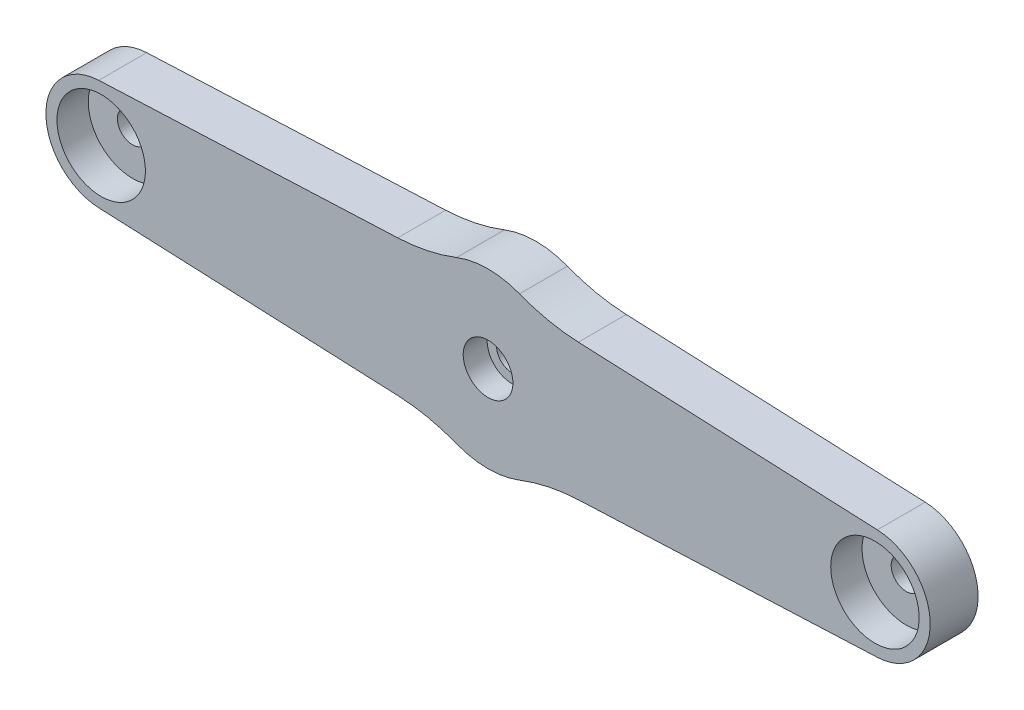
ISO-10303-21;
HEADER;
FILE_DESCRIPTION(('STEP AP214'),'2;1');
FILE_NAME('part.step','',(''),(''),'','','');
FILE_SCHEMA(('AUTOMOTIVE_DESIGN { 1 0 10303 214 1 1 1 1 }'));
ENDSEC;
DATA;
#1=APPLICATION_CONTEXT('core data for automotive mechanical design processes');
#2=APPLICATION_PROTOCOL_DEFINITION('international standard','automotive_design',2000,#1);
#3=PRODUCT_CONTEXT('',#1,'mechanical');
#4=PRODUCT('Part','Part','',(#3));
#5=PRODUCT_RELATED_PRODUCT_CATEGORY('part','',(#4));
#6=PRODUCT_DEFINITION_FORMATION('','',#4);
#7=PRODUCT_DEFINITION_CONTEXT('part definition',#1,'design');
#8=PRODUCT_DEFINITION('design','',#6,#7);
#9=PRODUCT_DEFINITION_SHAPE('','',#8);
#10=(LENGTH_UNIT() NAMED_UNIT(*) SI_UNIT(.MILLI.,.METRE.));
#11=(NAMED_UNIT(*) PLANE_ANGLE_UNIT() SI_UNIT($,.RADIAN.));
#12=(NAMED_UNIT(*) SI_UNIT($,.STERADIAN.) SOLID_ANGLE_UNIT());
#13=UNCERTAINTY_MEASURE_WITH_UNIT(LENGTH_MEASURE(1.E-05),#10,'distance_accuracy_value','');
#14=(GEOMETRIC_REPRESENTATION_CONTEXT(3) GLOBAL_UNCERTAINTY_ASSIGNED_CONTEXT((#13)) GLOBAL_UNIT_ASSIGNED_CONTEXT((#10,
#11,#12)) REPRESENTATION_CONTEXT('',''));
#15=CARTESIAN_POINT('',(0.,0.,0.));
#16=DIRECTION('',(0.,0.,1.));
#17=DIRECTION('',(1.,0.,0.));
#18=AXIS2_PLACEMENT_3D('',#15,#16,#17);
#19=CARTESIAN_POINT('',(0.,29.,75.25));
#20=DIRECTION('',(0.,0.,-1.));
#21=DIRECTION('',(-1.,0.,0.));
#22=AXIS2_PLACEMENT_3D('',#19,#20,#21);
#23=CYLINDRICAL_SURFACE('',#22,6.75);
#24=CARTESIAN_POINT('',(0.,29.,72.));
#25=DIRECTION('',(0.,0.,-1.));
#26=DIRECTION('',(-1.,0.,0.));
#27=AXIS2_PLACEMENT_3D('',#24,#25,#26);
#28=CIRCLE('',#27,6.75);
#29=CARTESIAN_POINT('',(-6.74999999999998,29.,72.));
#30=VERTEX_POINT('',#29);
#31=EDGE_CURVE('E205',#30,#30,#28,.T.);
#32=ORIENTED_EDGE('',*,*,#31,.T.);
#33=EDGE_LOOP('',(#32));
#34=FACE_BOUND('',#33,.T.);
#35=CARTESIAN_POINT('',(0.,29.,78.5));
#36=DIRECTION('',(0.,0.,-1.));
#37=DIRECTION('',(-1.,0.,0.));
#38=AXIS2_PLACEMENT_3D('',#35,#36,#37);
#39=CIRCLE('',#38,6.75);
#40=CARTESIAN_POINT('',(-6.74999999999998,29.,78.5));
#41=VERTEX_POINT('',#40);
#42=EDGE_CURVE('E19',#41,#41,#39,.T.);
#43=ORIENTED_EDGE('',*,*,#42,.F.);
#44=EDGE_LOOP('',(#43));
#45=FACE_BOUND('',#44,.T.);
#46=ADVANCED_FACE('F16',(#34,#45),#23,.F.);
#47=CARTESIAN_POINT('',(-105.,29.,78.5));
#48=DIRECTION('',(0.,0.,-1.));
#49=DIRECTION('',(-1.,0.,0.));
#50=AXIS2_PLACEMENT_3D('',#47,#48,#49);
#51=CYLINDRICAL_SURFACE('',#50,12.);
#52=CARTESIAN_POINT('',(-105.,29.,70.));
#53=DIRECTION('',(0.,0.,-1.));
#54=DIRECTION('',(-1.,0.,0.));
#55=AXIS2_PLACEMENT_3D('',#52,#53,#54);
#56=CIRCLE('',#55,12.);
#57=CARTESIAN_POINT('',(-117.,29.,70.));
#58=VERTEX_POINT('',#57);
#59=EDGE_CURVE('E202',#58,#58,#56,.F.);
#60=ORIENTED_EDGE('',*,*,#59,.F.);
#61=EDGE_LOOP('',(#60));
#62=FACE_BOUND('',#61,.T.);
#63=CARTESIAN_POINT('',(-105.,29.,78.5));
#64=DIRECTION('',(0.,0.,-1.));
#65=DIRECTION('',(-1.,0.,0.));
#66=AXIS2_PLACEMENT_3D('',#63,#64,#65);
#67=CIRCLE('',#66,12.);
#68=CARTESIAN_POINT('',(-117.,29.,78.5));
#69=VERTEX_POINT('',#68);
#70=EDGE_CURVE('E208',#69,#69,#67,.T.);
#71=ORIENTED_EDGE('',*,*,#70,.F.);
#72=EDGE_LOOP('',(#71));
#73=FACE_BOUND('',#72,.T.);
#74=ADVANCED_FACE('F219',(#62,#73),#51,.F.);
#75=CARTESIAN_POINT('',(105.,29.,78.5));
#76=DIRECTION('',(0.,0.,-1.));
#77=DIRECTION('',(-1.,0.,0.));
#78=AXIS2_PLACEMENT_3D('',#75,#76,#77);
#79=CYLINDRICAL_SURFACE('',#78,12.);
#80=CARTESIAN_POINT('',(105.,29.,70.));
#81=DIRECTION('',(0.,0.,-1.));
#82=DIRECTION('',(-1.,0.,0.));
#83=AXIS2_PLACEMENT_3D('',#80,#81,#82);
#84=CIRCLE('',#83,12.);
#85=CARTESIAN_POINT('',(93.,29.,70.));
#86=VERTEX_POINT('',#85);
#87=EDGE_CURVE('E139',#86,#86,#84,.F.);
#88=ORIENTED_EDGE('',*,*,#87,.F.);
#89=EDGE_LOOP('',(#88));
#90=FACE_BOUND('',#89,.T.);
#91=CARTESIAN_POINT('',(105.,29.,78.5));
#92=DIRECTION('',(0.,0.,-1.));
#93=DIRECTION('',(-1.,0.,0.));
#94=AXIS2_PLACEMENT_3D('',#91,#92,#93);
#95=CIRCLE('',#94,12.);
#96=CARTESIAN_POINT('',(93.,29.,78.5));
#97=VERTEX_POINT('',#96);
#98=EDGE_CURVE('E210',#97,#97,#95,.T.);
#99=ORIENTED_EDGE('',*,*,#98,.F.);
#100=EDGE_LOOP('',(#99));
#101=FACE_BOUND('',#100,.T.);
#102=ADVANCED_FACE('F225',(#90,#101),#79,.F.);
#103=CARTESIAN_POINT('',(0.,29.0000000000001,78.5));
#104=DIRECTION('',(0.,0.,1.));
#105=DIRECTION('',(1.,0.,0.));
#106=AXIS2_PLACEMENT_3D('',#103,#104,#105);
#107=PLANE('',#106);
#108=ORIENTED_EDGE('',*,*,#70,.T.);
#109=EDGE_LOOP('',(#108));
#110=FACE_BOUND('',#109,.T.);
#111=ORIENTED_EDGE('',*,*,#98,.T.);
#112=EDGE_LOOP('',(#111));
#113=FACE_BOUND('',#112,.T.);
#114=ORIENTED_EDGE('',*,*,#42,.T.);
#115=EDGE_LOOP('',(#114));
#116=FACE_BOUND('',#115,.T.);
#117=CARTESIAN_POINT('',(26.6951631788374,-39.4807875455241,78.5));
#118=DIRECTION('',(0.,0.,1.));
#119=DIRECTION('',(1.,0.,0.));
#120=AXIS2_PLACEMENT_3D('',#117,#118,#119);
#121=CIRCLE('',#120,50.);
#122=CARTESIAN_POINT('',(8.5351882272473,7.10478221333597,78.5));
#123=VERTEX_POINT('',#122);
#124=CARTESIAN_POINT('',(24.5141938105712,10.4716235335688,78.5));
#125=VERTEX_POINT('',#124);
#126=EDGE_CURVE('E137',#123,#125,#121,.F.);
#127=ORIENTED_EDGE('',*,*,#126,.T.);
#128=DIRECTION('',(0.999048221581858,0.0436193873653249,0.));
#129=VECTOR('',#128,1.);
#130=CARTESIAN_POINT('',(24.5141938105712,10.4716235335688,78.5));
#131=LINE('',#130,#129);
#132=CARTESIAN_POINT('',(105.65429081048,14.014276676272,78.5));
#133=VERTEX_POINT('',#132);
#134=EDGE_CURVE('E134',#133,#125,#131,.F.);
#135=ORIENTED_EDGE('',*,*,#134,.F.);
#136=CARTESIAN_POINT('',(105.,29.,78.5));
#137=DIRECTION('',(0.,0.,1.));
#138=DIRECTION('',(1.,0.,0.));
#139=AXIS2_PLACEMENT_3D('',#136,#137,#138);
#140=CIRCLE('',#139,15.0000000000001);
#141=CARTESIAN_POINT('',(105.65429081048,43.9857233237279,78.5));
#142=VERTEX_POINT('',#141);
#143=EDGE_CURVE('E185',#142,#133,#140,.F.);
#144=ORIENTED_EDGE('',*,*,#143,.F.);
#145=DIRECTION('',(-0.999048221581858,0.0436193873653404,0.));
#146=VECTOR('',#145,1.);
#147=CARTESIAN_POINT('',(105.65429081048,43.9857233237279,78.5));
#148=LINE('',#147,#146);
#149=CARTESIAN_POINT('',(24.5141938105676,47.5283764664326,78.5));
#150=VERTEX_POINT('',#149);
#151=EDGE_CURVE('E102',#150,#142,#148,.F.);
#152=ORIENTED_EDGE('',*,*,#151,.F.);
#153=CARTESIAN_POINT('',(26.6951631788346,97.4807875455255,78.5));
#154=DIRECTION('',(0.,0.,1.));
#155=DIRECTION('',(1.,0.,0.));
#156=AXIS2_PLACEMENT_3D('',#153,#154,#155);
#157=CIRCLE('',#156,50.);
#158=CARTESIAN_POINT('',(8.53518822724645,50.8952177866646,78.5));
#159=VERTEX_POINT('',#158);
#160=EDGE_CURVE('E116',#150,#159,#157,.F.);
#161=ORIENTED_EDGE('',*,*,#160,.T.);
#162=CARTESIAN_POINT('',(0.,29.,78.5));
#163=DIRECTION('',(0.,0.,1.));
#164=DIRECTION('',(1.,0.,0.));
#165=AXIS2_PLACEMENT_3D('',#162,#163,#164);
#166=CIRCLE('',#165,23.5);
#167=CARTESIAN_POINT('',(-8.53518822724637,50.8952177866646,78.5));
#168=VERTEX_POINT('',#167);
#169=EDGE_CURVE('E107',#168,#159,#166,.F.);
#170=ORIENTED_EDGE('',*,*,#169,.F.);
#171=CARTESIAN_POINT('',(-26.6951631788344,97.4807875455255,78.5));
#172=DIRECTION('',(0.,0.,1.));
#173=DIRECTION('',(1.,0.,0.));
#174=AXIS2_PLACEMENT_3D('',#171,#172,#173);
#175=CIRCLE('',#174,50.);
#176=CARTESIAN_POINT('',(-24.5141938105673,47.5283764664327,78.5));
#177=VERTEX_POINT('',#176);
#178=EDGE_CURVE('E129',#168,#177,#175,.F.);
#179=ORIENTED_EDGE('',*,*,#178,.T.);
#180=DIRECTION('',(-0.999048221581857,-0.043619387365342,0.));
#181=VECTOR('',#180,1.);
#182=CARTESIAN_POINT('',(-24.5141938105672,47.5283764664327,78.5));
#183=LINE('',#182,#181);
#184=CARTESIAN_POINT('',(-105.65429081048,43.9857233237279,78.5));
#185=VERTEX_POINT('',#184);
#186=EDGE_CURVE('E144',#185,#177,#183,.F.);
#187=ORIENTED_EDGE('',*,*,#186,.F.);
#188=CARTESIAN_POINT('',(-105.,29.,78.5));
#189=DIRECTION('',(0.,0.,1.));
#190=DIRECTION('',(1.,0.,0.));
#191=AXIS2_PLACEMENT_3D('',#188,#189,#190);
#192=CIRCLE('',#191,15.);
#193=CARTESIAN_POINT('',(-105.65429081048,14.0142766762721,78.5));
#194=VERTEX_POINT('',#193);
#195=EDGE_CURVE('E197',#194,#185,#192,.F.);
#196=ORIENTED_EDGE('',*,*,#195,.F.);
#197=DIRECTION('',(0.999048221581858,-0.0436193873653238,0.));
#198=VECTOR('',#197,1.);
#199=CARTESIAN_POINT('',(-105.65429081048,14.0142766762721,78.5));
#200=LINE('',#199,#198);
#201=CARTESIAN_POINT('',(-24.5141938105718,10.471623533569,78.5));
#202=VERTEX_POINT('',#201);
#203=EDGE_CURVE('E140',#202,#194,#200,.F.);
#204=ORIENTED_EDGE('',*,*,#203,.F.);
#205=CARTESIAN_POINT('',(-26.695163178838,-39.4807875455239,78.5));
#206=DIRECTION('',(0.,0.,1.));
#207=DIRECTION('',(1.,0.,0.));
#208=AXIS2_PLACEMENT_3D('',#205,#206,#207);
#209=CIRCLE('',#208,50.);
#210=CARTESIAN_POINT('',(-8.53518822724747,7.10478221333602,78.5));
#211=VERTEX_POINT('',#210);
#212=EDGE_CURVE('E193',#202,#211,#209,.F.);
#213=ORIENTED_EDGE('',*,*,#212,.T.);
#214=CARTESIAN_POINT('',(0.,29.,78.5));
#215=DIRECTION('',(0.,0.,1.));
#216=DIRECTION('',(1.,0.,0.));
#217=AXIS2_PLACEMENT_3D('',#214,#215,#216);
#218=CIRCLE('',#217,23.4999999999998);
#219=EDGE_CURVE('E190',#123,#211,#218,.F.);
#220=ORIENTED_EDGE('',*,*,#219,.F.);
#221=EDGE_LOOP('',(#127,#135,#144,#152,#161,#170,#179,#187,#196,#204,#213,#220));
#222=FACE_BOUND('',#221,.T.);
#223=ADVANCED_FACE('F119',(#110,#113,#116,#222),#107,.T.);
#224=CARTESIAN_POINT('',(0.,29.,72.));
#225=DIRECTION('',(0.,0.,-1.));
#226=DIRECTION('',(-1.,0.,0.));
#227=AXIS2_PLACEMENT_3D('',#224,#225,#226);
#228=PLANE('',#227);
#229=CARTESIAN_POINT('',(0.,29.,72.));
#230=DIRECTION('',(0.,0.,-1.));
#231=DIRECTION('',(-1.,0.,0.));
#232=AXIS2_PLACEMENT_3D('',#229,#230,#231);
#233=CIRCLE('',#232,4.2);
#234=CARTESIAN_POINT('',(-4.19999999999998,29.,72.));
#235=VERTEX_POINT('',#234);
#236=EDGE_CURVE('E182',#235,#235,#233,.T.);
#237=ORIENTED_EDGE('',*,*,#236,.T.);
#238=EDGE_LOOP('',(#237));
#239=FACE_BOUND('',#238,.T.);
#240=ORIENTED_EDGE('',*,*,#31,.F.);
#241=EDGE_LOOP('',(#240));
#242=FACE_BOUND('',#241,.T.);
#243=ADVANCED_FACE('F298',(#239,#242),#228,.F.);
#244=CARTESIAN_POINT('',(-105.,29.,70.));
#245=DIRECTION('',(0.,0.,1.));
#246=DIRECTION('',(1.,0.,0.));
#247=AXIS2_PLACEMENT_3D('',#244,#245,#246);
#248=PLANE('',#247);
#249=CARTESIAN_POINT('',(-105.,29.,70.));
#250=DIRECTION('',(0.,0.,-1.));
#251=DIRECTION('',(0.,1.,0.));
#252=AXIS2_PLACEMENT_3D('',#249,#250,#251);
#253=CIRCLE('',#252,4.1);
#254=CARTESIAN_POINT('',(-105.,33.1,70.));
#255=VERTEX_POINT('',#254);
#256=EDGE_CURVE('E179',#255,#255,#253,.T.);
#257=ORIENTED_EDGE('',*,*,#256,.T.);
#258=EDGE_LOOP('',(#257));
#259=FACE_BOUND('',#258,.T.);
#260=ORIENTED_EDGE('',*,*,#59,.T.);
#261=EDGE_LOOP('',(#260));
#262=FACE_BOUND('',#261,.T.);
#263=ADVANCED_FACE('F294',(#259,#262),#248,.T.);
#264=CARTESIAN_POINT('',(105.,29.,70.));
#265=DIRECTION('',(0.,0.,1.));
#266=DIRECTION('',(1.,0.,0.));
#267=AXIS2_PLACEMENT_3D('',#264,#265,#266);
#268=PLANE('',#267);
#269=CARTESIAN_POINT('',(105.,29.,70.));
#270=DIRECTION('',(0.,0.,-1.));
#271=DIRECTION('',(0.,1.,0.));
#272=AXIS2_PLACEMENT_3D('',#269,#270,#271);
#273=CIRCLE('',#272,4.1);
#274=CARTESIAN_POINT('',(105.,33.1,70.));
#275=VERTEX_POINT('',#274);
#276=EDGE_CURVE('E176',#275,#275,#273,.T.);
#277=ORIENTED_EDGE('',*,*,#276,.T.);
#278=EDGE_LOOP('',(#277));
#279=FACE_BOUND('',#278,.T.);
#280=ORIENTED_EDGE('',*,*,#87,.T.);
#281=EDGE_LOOP('',(#280));
#282=FACE_BOUND('',#281,.T.);
#283=ADVANCED_FACE('F290',(#279,#282),#268,.T.);
#284=CARTESIAN_POINT('',(105.65429081048,43.9857233237279,65.5));
#285=DIRECTION('',(0.0436193873653404,0.999048221581858,0.));
#286=DIRECTION('',(-0.999048221581858,0.0436193873653404,0.));
#287=AXIS2_PLACEMENT_3D('',#284,#285,#286);
#288=PLANE('',#287);
#289=ORIENTED_EDGE('',*,*,#151,.T.);
#290=DIRECTION('',(0.,0.,1.));
#291=VECTOR('',#290,1.);
#292=CARTESIAN_POINT('',(105.65429081048,43.985723323728,65.5));
#293=LINE('',#292,#291);
#294=CARTESIAN_POINT('',(105.65429081048,43.9857233237279,65.5));
#295=VERTEX_POINT('',#294);
#296=EDGE_CURVE('E187',#295,#142,#293,.T.);
#297=ORIENTED_EDGE('',*,*,#296,.F.);
#298=DIRECTION('',(-0.999048221581858,0.0436193873653408,0.));
#299=VECTOR('',#298,1.);
#300=CARTESIAN_POINT('',(105.65429081048,43.9857233237279,65.5));
#301=LINE('',#300,#299);
#302=CARTESIAN_POINT('',(24.5141938105676,47.5283764664326,65.5));
#303=VERTEX_POINT('',#302);
#304=EDGE_CURVE('E175',#295,#303,#301,.T.);
#305=ORIENTED_EDGE('',*,*,#304,.T.);
#306=DIRECTION('',(0.,0.,1.));
#307=VECTOR('',#306,1.);
#308=CARTESIAN_POINT('',(24.5141938105676,47.5283764664326,65.5));
#309=LINE('',#308,#307);
#310=EDGE_CURVE('E122',#303,#150,#309,.T.);
#311=ORIENTED_EDGE('',*,*,#310,.T.);
#312=EDGE_LOOP('',(#289,#297,#305,#311));
#313=FACE_BOUND('',#312,.T.);
#314=ADVANCED_FACE('F287',(#313),#288,.T.);
#315=CARTESIAN_POINT('',(26.6951631788346,97.4807875455255,65.5));
#316=DIRECTION('',(0.,0.,1.));
#317=DIRECTION('',(1.,0.,0.));
#318=AXIS2_PLACEMENT_3D('',#315,#316,#317);
#319=CYLINDRICAL_SURFACE('',#318,50.);
#320=DIRECTION('',(0.,0.,1.));
#321=VECTOR('',#320,1.);
#322=CARTESIAN_POINT('',(8.53518822724645,50.8952177866646,65.5));
#323=LINE('',#322,#321);
#324=CARTESIAN_POINT('',(8.53518822724645,50.8952177866646,65.5));
#325=VERTEX_POINT('',#324);
#326=EDGE_CURVE('E111',#159,#325,#323,.F.);
#327=ORIENTED_EDGE('',*,*,#326,.F.);
#328=ORIENTED_EDGE('',*,*,#160,.F.);
#329=ORIENTED_EDGE('',*,*,#310,.F.);
#330=CARTESIAN_POINT('',(26.6951631788346,97.4807875455255,65.5));
#331=DIRECTION('',(0.,0.,1.));
#332=DIRECTION('',(1.,0.,0.));
#333=AXIS2_PLACEMENT_3D('',#330,#331,#332);
#334=CIRCLE('',#333,50.);
#335=EDGE_CURVE('E127',#303,#325,#334,.F.);
#336=ORIENTED_EDGE('',*,*,#335,.T.);
#337=EDGE_LOOP('',(#327,#328,#329,#336));
#338=FACE_BOUND('',#337,.T.);
#339=ADVANCED_FACE('F125',(#338),#319,.F.);
#340=CARTESIAN_POINT('',(0.,29.,65.5));
#341=DIRECTION('',(0.,0.,1.));
#342=DIRECTION('',(1.,0.,0.));
#343=AXIS2_PLACEMENT_3D('',#340,#341,#342);
#344=CYLINDRICAL_SURFACE('',#343,23.5);
#345=ORIENTED_EDGE('',*,*,#169,.T.);
#346=ORIENTED_EDGE('',*,*,#326,.T.);
#347=CARTESIAN_POINT('',(0.,29.,65.5));
#348=DIRECTION('',(0.,0.,1.));
#349=DIRECTION('',(1.,0.,0.));
#350=AXIS2_PLACEMENT_3D('',#347,#348,#349);
#351=CIRCLE('',#350,23.5);
#352=CARTESIAN_POINT('',(-8.53518822724636,50.8952177866646,65.5));
#353=VERTEX_POINT('',#352);
#354=EDGE_CURVE('E172',#325,#353,#351,.T.);
#355=ORIENTED_EDGE('',*,*,#354,.T.);
#356=DIRECTION('',(0.,0.,1.));
#357=VECTOR('',#356,1.);
#358=CARTESIAN_POINT('',(-8.53518822724638,50.8952177866646,65.5));
#359=LINE('',#358,#357);
#360=EDGE_CURVE('E113',#353,#168,#359,.T.);
#361=ORIENTED_EDGE('',*,*,#360,.T.);
#362=EDGE_LOOP('',(#345,#346,#355,#361));
#363=FACE_BOUND('',#362,.T.);
#364=ADVANCED_FACE('F108',(#363),#344,.T.);
#365=CARTESIAN_POINT('',(-26.6951631788344,97.4807875455255,65.5));
#366=DIRECTION('',(0.,0.,1.));
#367=DIRECTION('',(1.,0.,0.));
#368=AXIS2_PLACEMENT_3D('',#365,#366,#367);
#369=CYLINDRICAL_SURFACE('',#368,50.);
#370=DIRECTION('',(0.,0.,1.));
#371=VECTOR('',#370,1.);
#372=CARTESIAN_POINT('',(-24.5141938105673,47.5283764664327,65.5));
#373=LINE('',#372,#371);
#374=CARTESIAN_POINT('',(-24.5141938105673,47.5283764664327,65.5));
#375=VERTEX_POINT('',#374);
#376=EDGE_CURVE('E145',#177,#375,#373,.F.);
#377=ORIENTED_EDGE('',*,*,#376,.F.);
#378=ORIENTED_EDGE('',*,*,#178,.F.);
#379=ORIENTED_EDGE('',*,*,#360,.F.);
#380=CARTESIAN_POINT('',(-26.6951631788344,97.4807875455255,65.5));
#381=DIRECTION('',(0.,0.,1.));
#382=DIRECTION('',(1.,0.,0.));
#383=AXIS2_PLACEMENT_3D('',#380,#381,#382);
#384=CIRCLE('',#383,50.);
#385=EDGE_CURVE('E169',#353,#375,#384,.F.);
#386=ORIENTED_EDGE('',*,*,#385,.T.);
#387=EDGE_LOOP('',(#377,#378,#379,#386));
#388=FACE_BOUND('',#387,.T.);
#389=ADVANCED_FACE('F278',(#388),#369,.F.);
#390=CARTESIAN_POINT('',(-24.5141938105672,47.5283764664327,65.5));
#391=DIRECTION('',(-0.043619387365342,0.999048221581857,0.));
#392=DIRECTION('',(-0.999048221581857,-0.043619387365342,0.));
#393=AXIS2_PLACEMENT_3D('',#390,#391,#392);
#394=PLANE('',#393);
#395=ORIENTED_EDGE('',*,*,#186,.T.);
#396=ORIENTED_EDGE('',*,*,#376,.T.);
#397=DIRECTION('',(-0.999048221581858,-0.0436193873653418,0.));
#398=VECTOR('',#397,1.);
#399=CARTESIAN_POINT('',(-24.5141938105673,47.5283764664327,65.5));
#400=LINE('',#399,#398);
#401=CARTESIAN_POINT('',(-105.65429081048,43.9857233237279,65.5));
#402=VERTEX_POINT('',#401);
#403=EDGE_CURVE('E168',#375,#402,#400,.T.);
#404=ORIENTED_EDGE('',*,*,#403,.T.);
#405=DIRECTION('',(0.,0.,1.));
#406=VECTOR('',#405,1.);
#407=CARTESIAN_POINT('',(-105.65429081048,43.9857233237279,65.5));
#408=LINE('',#407,#406);
#409=EDGE_CURVE('E143',#185,#402,#408,.F.);
#410=ORIENTED_EDGE('',*,*,#409,.F.);
#411=EDGE_LOOP('',(#395,#396,#404,#410));
#412=FACE_BOUND('',#411,.T.);
#413=ADVANCED_FACE('F274',(#412),#394,.T.);
#414=CARTESIAN_POINT('',(-105.,29.,65.5));
#415=DIRECTION('',(0.,0.,1.));
#416=DIRECTION('',(1.,0.,0.));
#417=AXIS2_PLACEMENT_3D('',#414,#415,#416);
#418=CYLINDRICAL_SURFACE('',#417,15.);
#419=ORIENTED_EDGE('',*,*,#195,.T.);
#420=ORIENTED_EDGE('',*,*,#409,.T.);
#421=CARTESIAN_POINT('',(-105.,29.,65.5));
#422=DIRECTION('',(0.,0.,1.));
#423=DIRECTION('',(1.,0.,0.));
#424=AXIS2_PLACEMENT_3D('',#421,#422,#423);
#425=CIRCLE('',#424,15.);
#426=CARTESIAN_POINT('',(-105.65429081048,14.0142766762721,65.5));
#427=VERTEX_POINT('',#426);
#428=EDGE_CURVE('E165',#402,#427,#425,.T.);
#429=ORIENTED_EDGE('',*,*,#428,.T.);
#430=DIRECTION('',(0.,0.,1.));
#431=VECTOR('',#430,1.);
#432=CARTESIAN_POINT('',(-105.65429081048,14.0142766762721,65.5));
#433=LINE('',#432,#431);
#434=EDGE_CURVE('E142',#194,#427,#433,.F.);
#435=ORIENTED_EDGE('',*,*,#434,.F.);
#436=EDGE_LOOP('',(#419,#420,#429,#435));
#437=FACE_BOUND('',#436,.T.);
#438=ADVANCED_FACE('F270',(#437),#418,.T.);
#439=CARTESIAN_POINT('',(-105.65429081048,14.0142766762721,65.5));
#440=DIRECTION('',(-0.0436193873653238,-0.999048221581858,0.));
#441=DIRECTION('',(0.999048221581858,-0.0436193873653238,0.));
#442=AXIS2_PLACEMENT_3D('',#439,#440,#441);
#443=PLANE('',#442);
#444=ORIENTED_EDGE('',*,*,#203,.T.);
#445=ORIENTED_EDGE('',*,*,#434,.T.);
#446=DIRECTION('',(0.999048221581858,-0.0436193873653234,0.));
#447=VECTOR('',#446,1.);
#448=CARTESIAN_POINT('',(-105.65429081048,14.0142766762721,65.5));
#449=LINE('',#448,#447);
#450=CARTESIAN_POINT('',(-24.5141938105718,10.471623533569,65.5));
#451=VERTEX_POINT('',#450);
#452=EDGE_CURVE('E164',#427,#451,#449,.T.);
#453=ORIENTED_EDGE('',*,*,#452,.T.);
#454=DIRECTION('',(0.,0.,1.));
#455=VECTOR('',#454,1.);
#456=CARTESIAN_POINT('',(-24.5141938105718,10.471623533569,65.5));
#457=LINE('',#456,#455);
#458=EDGE_CURVE('E196',#451,#202,#457,.T.);
#459=ORIENTED_EDGE('',*,*,#458,.T.);
#460=EDGE_LOOP('',(#444,#445,#453,#459));
#461=FACE_BOUND('',#460,.T.);
#462=ADVANCED_FACE('F266',(#461),#443,.T.);
#463=CARTESIAN_POINT('',(-26.695163178838,-39.4807875455239,65.5));
#464=DIRECTION('',(0.,0.,1.));
#465=DIRECTION('',(1.,0.,0.));
#466=AXIS2_PLACEMENT_3D('',#463,#464,#465);
#467=CYLINDRICAL_SURFACE('',#466,50.);
#468=DIRECTION('',(0.,0.,1.));
#469=VECTOR('',#468,1.);
#470=CARTESIAN_POINT('',(-8.53518822724747,7.10478221333603,65.5));
#471=LINE('',#470,#469);
#472=CARTESIAN_POINT('',(-8.53518822724747,7.10478221333602,65.5));
#473=VERTEX_POINT('',#472);
#474=EDGE_CURVE('E192',#211,#473,#471,.F.);
#475=ORIENTED_EDGE('',*,*,#474,.F.);
#476=ORIENTED_EDGE('',*,*,#212,.F.);
#477=ORIENTED_EDGE('',*,*,#458,.F.);
#478=CARTESIAN_POINT('',(-26.695163178838,-39.4807875455239,65.5));
#479=DIRECTION('',(0.,0.,1.));
#480=DIRECTION('',(1.,0.,0.));
#481=AXIS2_PLACEMENT_3D('',#478,#479,#480);
#482=CIRCLE('',#481,50.);
#483=EDGE_CURVE('E161',#451,#473,#482,.F.);
#484=ORIENTED_EDGE('',*,*,#483,.T.);
#485=EDGE_LOOP('',(#475,#476,#477,#484));
#486=FACE_BOUND('',#485,.T.);
#487=ADVANCED_FACE('F262',(#486),#467,.F.);
#488=CARTESIAN_POINT('',(0.,29.,65.5));
#489=DIRECTION('',(0.,0.,1.));
#490=DIRECTION('',(1.,0.,0.));
#491=AXIS2_PLACEMENT_3D('',#488,#489,#490);
#492=CYLINDRICAL_SURFACE('',#491,23.4999999999998);
#493=ORIENTED_EDGE('',*,*,#219,.T.);
#494=ORIENTED_EDGE('',*,*,#474,.T.);
#495=CARTESIAN_POINT('',(0.,29.,65.5));
#496=DIRECTION('',(0.,0.,1.));
#497=DIRECTION('',(1.,0.,0.));
#498=AXIS2_PLACEMENT_3D('',#495,#496,#497);
#499=CIRCLE('',#498,23.4999999999998);
#500=CARTESIAN_POINT('',(8.53518822724729,7.104782213336,65.5));
#501=VERTEX_POINT('',#500);
#502=EDGE_CURVE('E158',#473,#501,#499,.T.);
#503=ORIENTED_EDGE('',*,*,#502,.T.);
#504=DIRECTION('',(0.,0.,1.));
#505=VECTOR('',#504,1.);
#506=CARTESIAN_POINT('',(8.53518822724729,7.104782213336,65.5));
#507=LINE('',#506,#505);
#508=EDGE_CURVE('E189',#501,#123,#507,.T.);
#509=ORIENTED_EDGE('',*,*,#508,.T.);
#510=EDGE_LOOP('',(#493,#494,#503,#509));
#511=FACE_BOUND('',#510,.T.);
#512=ADVANCED_FACE('F258',(#511),#492,.T.);
#513=CARTESIAN_POINT('',(26.6951631788374,-39.4807875455241,65.5));
#514=DIRECTION('',(0.,0.,1.));
#515=DIRECTION('',(1.,0.,0.));
#516=AXIS2_PLACEMENT_3D('',#513,#514,#515);
#517=CYLINDRICAL_SURFACE('',#516,50.);
#518=DIRECTION('',(0.,0.,1.));
#519=VECTOR('',#518,1.);
#520=CARTESIAN_POINT('',(24.5141938105712,10.4716235335688,65.5));
#521=LINE('',#520,#519);
#522=CARTESIAN_POINT('',(24.5141938105712,10.4716235335688,65.5));
#523=VERTEX_POINT('',#522);
#524=EDGE_CURVE('E136',#125,#523,#521,.F.);
#525=ORIENTED_EDGE('',*,*,#524,.F.);
#526=ORIENTED_EDGE('',*,*,#126,.F.);
#527=ORIENTED_EDGE('',*,*,#508,.F.);
#528=CARTESIAN_POINT('',(26.6951631788374,-39.4807875455241,65.5));
#529=DIRECTION('',(0.,0.,1.));
#530=DIRECTION('',(1.,0.,0.));
#531=AXIS2_PLACEMENT_3D('',#528,#529,#530);
#532=CIRCLE('',#531,50.);
#533=EDGE_CURVE('E155',#501,#523,#532,.F.);
#534=ORIENTED_EDGE('',*,*,#533,.T.);
#535=EDGE_LOOP('',(#525,#526,#527,#534));
#536=FACE_BOUND('',#535,.T.);
#537=ADVANCED_FACE('F254',(#536),#517,.F.);
#538=CARTESIAN_POINT('',(24.5141938105712,10.4716235335688,65.5));
#539=DIRECTION('',(0.0436193873653249,-0.999048221581858,0.));
#540=DIRECTION('',(0.999048221581858,0.0436193873653249,0.));
#541=AXIS2_PLACEMENT_3D('',#538,#539,#540);
#542=PLANE('',#541);
#543=ORIENTED_EDGE('',*,*,#134,.T.);
#544=ORIENTED_EDGE('',*,*,#524,.T.);
#545=DIRECTION('',(0.999048221581858,0.0436193873653243,0.));
#546=VECTOR('',#545,1.);
#547=CARTESIAN_POINT('',(24.5141938105712,10.4716235335688,65.5));
#548=LINE('',#547,#546);
#549=CARTESIAN_POINT('',(105.65429081048,14.014276676272,65.5));
#550=VERTEX_POINT('',#549);
#551=EDGE_CURVE('E154',#523,#550,#548,.T.);
#552=ORIENTED_EDGE('',*,*,#551,.T.);
#553=DIRECTION('',(0.,0.,1.));
#554=VECTOR('',#553,1.);
#555=CARTESIAN_POINT('',(105.65429081048,14.014276676272,65.5));
#556=LINE('',#555,#554);
#557=EDGE_CURVE('E34',#133,#550,#556,.F.);
#558=ORIENTED_EDGE('',*,*,#557,.F.);
#559=EDGE_LOOP('',(#543,#544,#552,#558));
#560=FACE_BOUND('',#559,.T.);
#561=ADVANCED_FACE('F251',(#560),#542,.T.);
#562=CARTESIAN_POINT('',(105.,29.,65.5));
#563=DIRECTION('',(0.,0.,1.));
#564=DIRECTION('',(1.,0.,0.));
#565=AXIS2_PLACEMENT_3D('',#562,#563,#564);
#566=CYLINDRICAL_SURFACE('',#565,15.0000000000001);
#567=ORIENTED_EDGE('',*,*,#143,.T.);
#568=ORIENTED_EDGE('',*,*,#557,.T.);
#569=CARTESIAN_POINT('',(105.,29.,65.5));
#570=DIRECTION('',(0.,0.,1.));
#571=DIRECTION('',(1.,0.,0.));
#572=AXIS2_PLACEMENT_3D('',#569,#570,#571);
#573=CIRCLE('',#572,15.0000000000001);
#574=EDGE_CURVE('E152',#550,#295,#573,.T.);
#575=ORIENTED_EDGE('',*,*,#574,.T.);
#576=ORIENTED_EDGE('',*,*,#296,.T.);
#577=EDGE_LOOP('',(#567,#568,#575,#576));
#578=FACE_BOUND('',#577,.T.);
#579=ADVANCED_FACE('F247',(#578),#566,.T.);
#580=CARTESIAN_POINT('',(0.,29.,63.287));
#581=DIRECTION('',(0.,0.,-1.));
#582=DIRECTION('',(-1.,0.,0.));
#583=AXIS2_PLACEMENT_3D('',#580,#581,#582);
#584=CYLINDRICAL_SURFACE('',#583,4.2);
#585=CARTESIAN_POINT('',(0.,29.,65.5));
#586=DIRECTION('',(0.,0.,-1.));
#587=DIRECTION('',(-1.,0.,0.));
#588=AXIS2_PLACEMENT_3D('',#585,#586,#587);
#589=CIRCLE('',#588,4.2);
#590=CARTESIAN_POINT('',(-4.19999999999998,29.,65.5));
#591=VERTEX_POINT('',#590);
#592=EDGE_CURVE('E149',#591,#591,#589,.T.);
#593=ORIENTED_EDGE('',*,*,#592,.T.);
#594=EDGE_LOOP('',(#593));
#595=FACE_BOUND('',#594,.T.);
#596=ORIENTED_EDGE('',*,*,#236,.F.);
#597=EDGE_LOOP('',(#596));
#598=FACE_BOUND('',#597,.T.);
#599=ADVANCED_FACE('F243',(#595,#598),#584,.F.);
#600=CARTESIAN_POINT('',(-105.,29.,75.495));
#601=DIRECTION('',(0.,0.,-1.));
#602=DIRECTION('',(0.,1.,0.));
#603=AXIS2_PLACEMENT_3D('',#600,#601,#602);
#604=CYLINDRICAL_SURFACE('',#603,4.1);
#605=CARTESIAN_POINT('',(-105.,29.,65.5));
#606=DIRECTION('',(0.,0.,-1.));
#607=DIRECTION('',(0.,1.,0.));
#608=AXIS2_PLACEMENT_3D('',#605,#606,#607);
#609=CIRCLE('',#608,4.1);
#610=CARTESIAN_POINT('',(-105.,33.1,65.5));
#611=VERTEX_POINT('',#610);
#612=EDGE_CURVE('E25',#611,#611,#609,.T.);
#613=ORIENTED_EDGE('',*,*,#612,.T.);
#614=EDGE_LOOP('',(#613));
#615=FACE_BOUND('',#614,.T.);
#616=ORIENTED_EDGE('',*,*,#256,.F.);
#617=EDGE_LOOP('',(#616));
#618=FACE_BOUND('',#617,.T.);
#619=ADVANCED_FACE('F235',(#615,#618),#604,.F.);
#620=CARTESIAN_POINT('',(105.,29.,75.495));
#621=DIRECTION('',(0.,0.,-1.));
#622=DIRECTION('',(0.,1.,0.));
#623=AXIS2_PLACEMENT_3D('',#620,#621,#622);
#624=CYLINDRICAL_SURFACE('',#623,4.1);
#625=CARTESIAN_POINT('',(105.,29.,65.5));
#626=DIRECTION('',(0.,0.,-1.));
#627=DIRECTION('',(0.,1.,0.));
#628=AXIS2_PLACEMENT_3D('',#625,#626,#627);
#629=CIRCLE('',#628,4.1);
#630=CARTESIAN_POINT('',(105.,33.1,65.5));
#631=VERTEX_POINT('',#630);
#632=EDGE_CURVE('E11',#631,#631,#629,.T.);
#633=ORIENTED_EDGE('',*,*,#632,.T.);
#634=EDGE_LOOP('',(#633));
#635=FACE_BOUND('',#634,.T.);
#636=ORIENTED_EDGE('',*,*,#276,.F.);
#637=EDGE_LOOP('',(#636));
#638=FACE_BOUND('',#637,.T.);
#639=ADVANCED_FACE('F229',(#635,#638),#624,.F.);
#640=CARTESIAN_POINT('',(0.,29.0000000000001,65.5));
#641=DIRECTION('',(0.,0.,1.));
#642=DIRECTION('',(1.,0.,0.));
#643=AXIS2_PLACEMENT_3D('',#640,#641,#642);
#644=PLANE('',#643);
#645=ORIENTED_EDGE('',*,*,#632,.F.);
#646=EDGE_LOOP('',(#645));
#647=FACE_BOUND('',#646,.T.);
#648=ORIENTED_EDGE('',*,*,#612,.F.);
#649=EDGE_LOOP('',(#648));
#650=FACE_BOUND('',#649,.T.);
#651=ORIENTED_EDGE('',*,*,#592,.F.);
#652=EDGE_LOOP('',(#651));
#653=FACE_BOUND('',#652,.T.);
#654=ORIENTED_EDGE('',*,*,#551,.F.);
#655=ORIENTED_EDGE('',*,*,#533,.F.);
#656=ORIENTED_EDGE('',*,*,#502,.F.);
#657=ORIENTED_EDGE('',*,*,#483,.F.);
#658=ORIENTED_EDGE('',*,*,#452,.F.);
#659=ORIENTED_EDGE('',*,*,#428,.F.);
#660=ORIENTED_EDGE('',*,*,#403,.F.);
#661=ORIENTED_EDGE('',*,*,#385,.F.);
#662=ORIENTED_EDGE('',*,*,#354,.F.);
#663=ORIENTED_EDGE('',*,*,#335,.F.);
#664=ORIENTED_EDGE('',*,*,#304,.F.);
#665=ORIENTED_EDGE('',*,*,#574,.F.);
#666=EDGE_LOOP('',(#654,#655,#656,#657,#658,#659,#660,#661,#662,#663,#664,#665));
#667=FACE_BOUND('',#666,.T.);
#668=ADVANCED_FACE('F227',(#647,#650,#653,#667),#644,.F.);
#669=CLOSED_SHELL('',(#46,#74,#102,#223,#243,#263,#283,#314,#339,#364,#389,#413,#438,#462,#487,
#512,#537,#561,#579,#599,#619,#639,#668));
#670=MANIFOLD_SOLID_BREP('B1',#669);
#671=ADVANCED_BREP_SHAPE_REPRESENTATION('',(#18,#670),#14);
#672=SHAPE_DEFINITION_REPRESENTATION(#9,#671);
ENDSEC;
END-ISO-10303-21;
